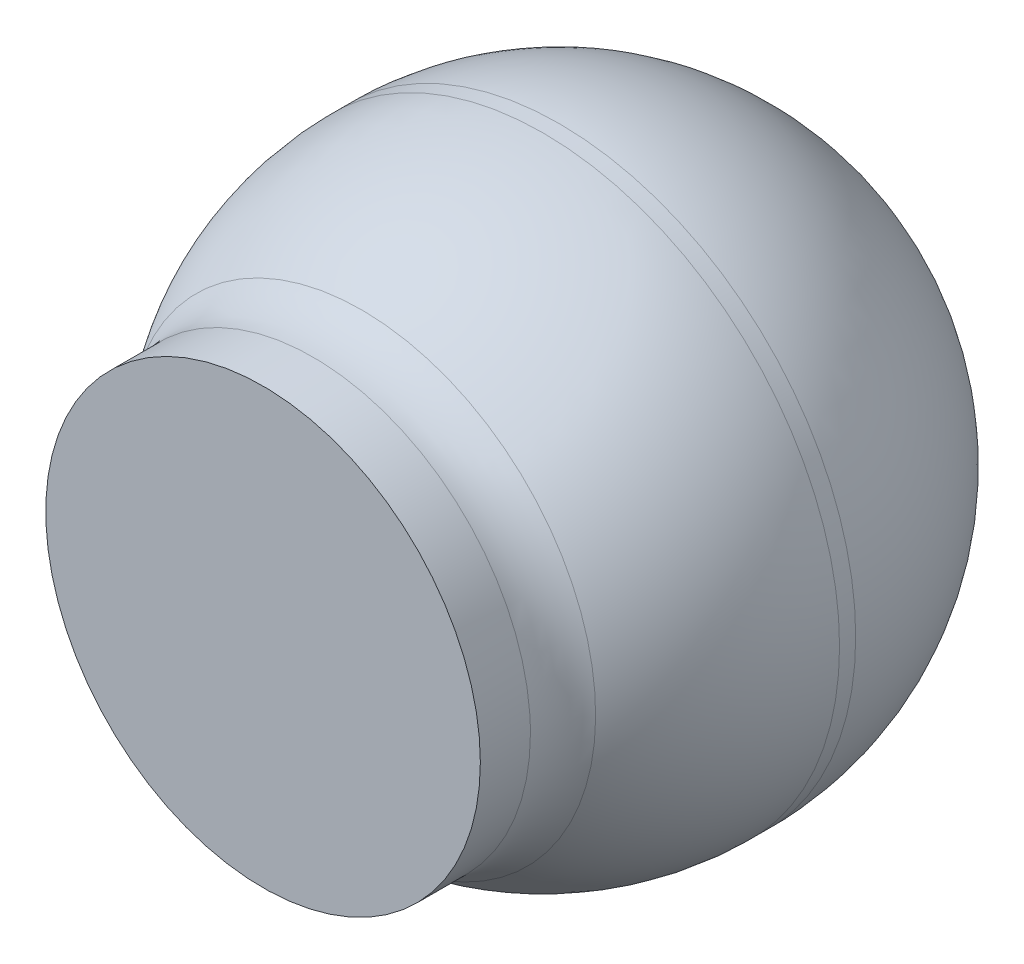
ISO-10303-21;
HEADER;
FILE_DESCRIPTION(('STEP AP214'),'2;1');
FILE_NAME('part.step','',(''),(''),'','','');
FILE_SCHEMA(('AUTOMOTIVE_DESIGN { 1 0 10303 214 1 1 1 1 }'));
ENDSEC;
DATA;
#1=APPLICATION_CONTEXT('core data for automotive mechanical design processes');
#2=APPLICATION_PROTOCOL_DEFINITION('international standard','automotive_design',2000,#1);
#3=PRODUCT_CONTEXT('',#1,'mechanical');
#4=PRODUCT('Part','Part','',(#3));
#5=PRODUCT_RELATED_PRODUCT_CATEGORY('part','',(#4));
#6=PRODUCT_DEFINITION_FORMATION('','',#4);
#7=PRODUCT_DEFINITION_CONTEXT('part definition',#1,'design');
#8=PRODUCT_DEFINITION('design','',#6,#7);
#9=PRODUCT_DEFINITION_SHAPE('','',#8);
#10=(LENGTH_UNIT() NAMED_UNIT(*) SI_UNIT(.MILLI.,.METRE.));
#11=(NAMED_UNIT(*) PLANE_ANGLE_UNIT() SI_UNIT($,.RADIAN.));
#12=(NAMED_UNIT(*) SI_UNIT($,.STERADIAN.) SOLID_ANGLE_UNIT());
#13=UNCERTAINTY_MEASURE_WITH_UNIT(LENGTH_MEASURE(1.E-05),#10,'distance_accuracy_value','');
#14=(GEOMETRIC_REPRESENTATION_CONTEXT(3) GLOBAL_UNCERTAINTY_ASSIGNED_CONTEXT((#13)) GLOBAL_UNIT_ASSIGNED_CONTEXT((#10,
#11,#12)) REPRESENTATION_CONTEXT('',''));
#15=CARTESIAN_POINT('',(0.,0.,0.));
#16=DIRECTION('',(0.,0.,1.));
#17=DIRECTION('',(1.,0.,0.));
#18=AXIS2_PLACEMENT_3D('',#15,#16,#17);
#19=CARTESIAN_POINT('',(-0.562919922269,-7.861349291452,10.006534503384));
#20=DIRECTION('',(0.,0.,-1.));
#21=DIRECTION('',(-1.,0.,0.));
#22=AXIS2_PLACEMENT_3D('',#19,#20,#21);
#23=PLANE('',#22);
#24=CARTESIAN_POINT('',(-0.562919922269,-7.861349291452,10.006534503384));
#25=DIRECTION('',(0.,0.,1.));
#26=DIRECTION('',(1.,0.,0.));
#27=AXIS2_PLACEMENT_3D('',#24,#25,#26);
#28=CIRCLE('',#27,0.275);
#29=CARTESIAN_POINT('',(-0.287919922269,-7.861349291452,10.006534503384));
#30=VERTEX_POINT('',#29);
#31=EDGE_CURVE('E20',#30,#30,#28,.F.);
#32=ORIENTED_EDGE('',*,*,#31,.F.);
#33=EDGE_LOOP('',(#32));
#34=FACE_BOUND('',#33,.T.);
#35=ADVANCED_FACE('F17',(#34),#23,.F.);
#36=CARTESIAN_POINT('',(-0.562919922269,-7.861349291452,9.906534503384));
#37=DIRECTION('',(0.,0.,1.));
#38=DIRECTION('',(1.,0.,0.));
#39=AXIS2_PLACEMENT_3D('',#36,#37,#38);
#40=CYLINDRICAL_SURFACE('',#39,0.275);
#41=CARTESIAN_POINT('',(-0.562919922269,-7.861349291452,9.943180457728));
#42=DIRECTION('',(0.,0.,-1.));
#43=DIRECTION('',(0.996700902337582,0.081162252799247,0.));
#44=AXIS2_PLACEMENT_3D('',#41,#42,#43);
#45=CIRCLE('',#44,0.275);
#46=CARTESIAN_POINT('',(-0.288827174126165,-7.83902967193221,9.943180457728));
#47=VERTEX_POINT('',#46);
#48=EDGE_CURVE('E65',#47,#47,#45,.F.);
#49=ORIENTED_EDGE('',*,*,#48,.T.);
#50=EDGE_LOOP('',(#49));
#51=FACE_BOUND('',#50,.T.);
#52=ORIENTED_EDGE('',*,*,#31,.T.);
#53=EDGE_LOOP('',(#52));
#54=FACE_BOUND('',#53,.T.);
#55=ADVANCED_FACE('F62',(#51,#54),#40,.T.);
#56=CARTESIAN_POINT('',(-0.562919922269,-7.861349291452,9.943180457728));
#57=DIRECTION('',(0.,0.,-1.));
#58=DIRECTION('',(0.996700902337583,0.0811622527992449,0.));
#59=AXIS2_PLACEMENT_3D('',#56,#57,#58);
#60=TOROIDAL_SURFACE('',#59,0.375,0.1);
#61=ORIENTED_EDGE('',*,*,#48,.F.);
#62=EDGE_LOOP('',(#61));
#63=FACE_BOUND('',#62,.T.);
#64=CARTESIAN_POINT('',(-0.562919922268999,-7.861349291452,9.881744931236));
#65=DIRECTION('',(0.,0.,-1.));
#66=DIRECTION('',(-0.996700902337597,-0.0811622527990622,0.));
#67=AXIS2_PLACEMENT_3D('',#64,#65,#66);
#68=CIRCLE('',#67,0.296097046412665);
#69=CARTESIAN_POINT('',(-0.858040115608,-7.885381194786,9.881744931236));
#70=VERTEX_POINT('',#69);
#71=EDGE_CURVE('E39',#70,#70,#68,.T.);
#72=ORIENTED_EDGE('',*,*,#71,.F.);
#73=EDGE_LOOP('',(#72));
#74=FACE_BOUND('',#73,.T.);
#75=ADVANCED_FACE('F57',(#63,#74),#60,.F.);
#76=CARTESIAN_POINT('',(-0.936682760645,-7.891785136252,9.651976062157));
#77=CARTESIAN_POINT('',(-0.936682760645,-7.891785136252,9.701461392103));
#78=CARTESIAN_POINT('',(-0.928526217348,-7.891120941579,9.750947004335));
#79=CARTESIAN_POINT('',(-0.912207085349,-7.889792059952,9.798626332798));
#80=CARTESIAN_POINT('',(-0.888341390838,-7.887848654938,9.842699544317));
#81=CARTESIAN_POINT('',(-0.858040115608,-7.885381194786,9.881744931236));
#82=(BOUNDED_CURVE() B_SPLINE_CURVE(5,(#76,#77,#78,#79,#80,#81),.UNSPECIFIED.,.F.,
.F.) B_SPLINE_CURVE_WITH_KNOTS((6,6),(0.,0.661568582165),
.UNSPECIFIED.) CURVE() GEOMETRIC_REPRESENTATION_ITEM() RATIONAL_B_SPLINE_CURVE((1.,1.,1.,1.,1.,1.)) REPRESENTATION_ITEM(''));
#83=CARTESIAN_POINT('',(-0.562919922269,-7.861349291452,9.651976062157));
#84=DIRECTION('',(0.,0.,-1.));
#85=AXIS1_PLACEMENT('',#83,#84);
#86=SURFACE_OF_REVOLUTION('',#82,#85);
#87=CARTESIAN_POINT('',(-0.562919922268999,-7.861349291452,9.651976062157));
#88=DIRECTION('',(0.,0.,1.));
#89=DIRECTION('',(1.,0.,0.));
#90=AXIS2_PLACEMENT_3D('',#87,#88,#89);
#91=CIRCLE('',#90,0.375);
#92=CARTESIAN_POINT('',(-0.187919922268999,-7.861349291452,9.651976062157));
#93=VERTEX_POINT('',#92);
#94=EDGE_CURVE('E36',#93,#93,#91,.F.);
#95=ORIENTED_EDGE('',*,*,#94,.F.);
#96=EDGE_LOOP('',(#95));
#97=FACE_BOUND('',#96,.T.);
#98=ORIENTED_EDGE('',*,*,#71,.T.);
#99=EDGE_LOOP('',(#98));
#100=FACE_BOUND('',#99,.T.);
#101=ADVANCED_FACE('F53',(#97,#100),#86,.F.);
#102=CARTESIAN_POINT('',(-0.562919922269,-7.861349291452,9.256534503384));
#103=DIRECTION('',(0.,0.,1.));
#104=DIRECTION('',(1.,0.,0.));
#105=AXIS2_PLACEMENT_3D('',#102,#103,#104);
#106=CYLINDRICAL_SURFACE('',#105,0.375);
#107=CARTESIAN_POINT('',(-0.562919922269,-7.861349291452,9.631534503384));
#108=DIRECTION('',(0.,0.,-1.));
#109=DIRECTION('',(0.0811622527992362,-0.996700902337583,0.));
#110=AXIS2_PLACEMENT_3D('',#107,#108,#109);
#111=CIRCLE('',#110,0.375);
#112=CARTESIAN_POINT('',(-0.532484077469287,-8.23511212982859,9.631534503384));
#113=VERTEX_POINT('',#112);
#114=CARTESIAN_POINT('',(-0.593355767068713,-7.48758645307541,9.631534503384));
#115=VERTEX_POINT('',#114);
#116=EDGE_CURVE('E11',#113,#115,#111,.T.);
#117=ORIENTED_EDGE('',*,*,#116,.F.);
#118=CARTESIAN_POINT('',(-0.562919922268999,-7.861349291452,9.631534503384));
#119=DIRECTION('',(0.,0.,1.));
#120=DIRECTION('',(0.0811622527992359,-0.996700902337583,0.));
#121=AXIS2_PLACEMENT_3D('',#118,#119,#120);
#122=CIRCLE('',#121,0.375);
#123=EDGE_CURVE('E25',#115,#113,#122,.F.);
#124=ORIENTED_EDGE('',*,*,#123,.F.);
#125=EDGE_LOOP('',(#117,#124));
#126=FACE_BOUND('',#125,.T.);
#127=ORIENTED_EDGE('',*,*,#94,.T.);
#128=EDGE_LOOP('',(#127));
#129=FACE_BOUND('',#128,.T.);
#130=ADVANCED_FACE('F34',(#126,#129),#106,.T.);
#131=CARTESIAN_POINT('',(-0.562919922269,-7.861349291452,9.631534503384));
#132=DIRECTION('',(0.0811622527992361,-0.996700902337583,0.));
#133=DIRECTION('',(-0.996700902337583,-0.0811622527992361,0.));
#134=AXIS2_PLACEMENT_3D('',#131,#132,#133);
#135=SPHERICAL_SURFACE('',#134,0.375);
#136=ORIENTED_EDGE('',*,*,#123,.T.);
#137=ORIENTED_EDGE('',*,*,#116,.T.);
#138=EDGE_LOOP('',(#136,#137));
#139=FACE_BOUND('',#138,.T.);
#140=ADVANCED_FACE('F32',(#139),#135,.T.);
#141=CLOSED_SHELL('',(#35,#55,#75,#101,#130,#140));
#142=MANIFOLD_SOLID_BREP('B1',#141);
#143=ADVANCED_BREP_SHAPE_REPRESENTATION('',(#18,#142),#14);
#144=SHAPE_DEFINITION_REPRESENTATION(#9,#143);
ENDSEC;
END-ISO-10303-21;
